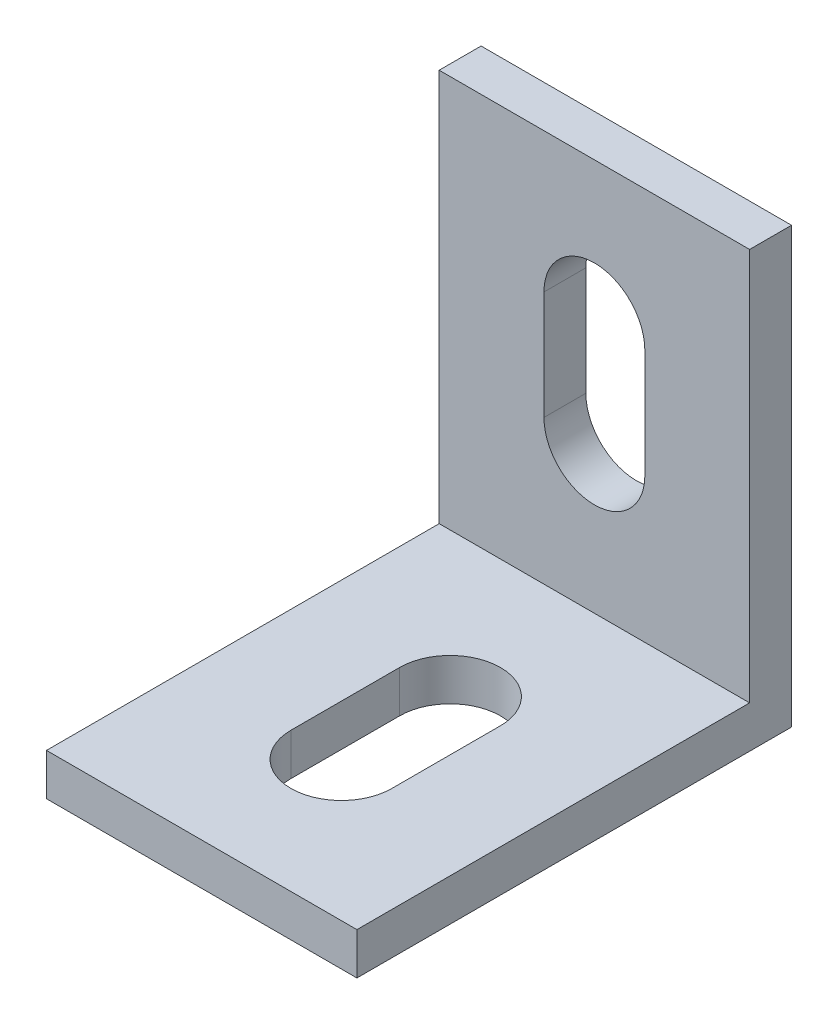
ISO-10303-21;
HEADER;
FILE_DESCRIPTION(('STEP AP214'),'2;1');
FILE_NAME('part.step','',(''),(''),'','','');
FILE_SCHEMA(('AUTOMOTIVE_DESIGN { 1 0 10303 214 1 1 1 1 }'));
ENDSEC;
DATA;
#1=APPLICATION_CONTEXT('core data for automotive mechanical design processes');
#2=APPLICATION_PROTOCOL_DEFINITION('international standard','automotive_design',2000,#1);
#3=PRODUCT_CONTEXT('',#1,'mechanical');
#4=PRODUCT('Part','Part','',(#3));
#5=PRODUCT_RELATED_PRODUCT_CATEGORY('part','',(#4));
#6=PRODUCT_DEFINITION_FORMATION('','',#4);
#7=PRODUCT_DEFINITION_CONTEXT('part definition',#1,'design');
#8=PRODUCT_DEFINITION('design','',#6,#7);
#9=PRODUCT_DEFINITION_SHAPE('','',#8);
#10=(LENGTH_UNIT() NAMED_UNIT(*) SI_UNIT(.MILLI.,.METRE.));
#11=(NAMED_UNIT(*) PLANE_ANGLE_UNIT() SI_UNIT($,.RADIAN.));
#12=(NAMED_UNIT(*) SI_UNIT($,.STERADIAN.) SOLID_ANGLE_UNIT());
#13=UNCERTAINTY_MEASURE_WITH_UNIT(LENGTH_MEASURE(1.E-05),#10,'distance_accuracy_value','');
#14=(GEOMETRIC_REPRESENTATION_CONTEXT(3) GLOBAL_UNCERTAINTY_ASSIGNED_CONTEXT((#13)) GLOBAL_UNIT_ASSIGNED_CONTEXT((#10,
#11,#12)) REPRESENTATION_CONTEXT('',''));
#15=CARTESIAN_POINT('',(0.,0.,0.));
#16=DIRECTION('',(0.,0.,1.));
#17=DIRECTION('',(1.,0.,0.));
#18=AXIS2_PLACEMENT_3D('',#15,#16,#17);
#19=CARTESIAN_POINT('',(0.,2.7,0.));
#20=DIRECTION('',(0.,1.,0.));
#21=DIRECTION('',(0.,0.,1.));
#22=AXIS2_PLACEMENT_3D('',#19,#20,#21);
#23=PLANE('',#22);
#24=DIRECTION('',(1.,0.,0.));
#25=VECTOR('',#24,1.);
#26=CARTESIAN_POINT('',(0.,2.7,-11.3));
#27=LINE('',#26,#25);
#28=CARTESIAN_POINT('',(-10.,2.7,-11.3));
#29=VERTEX_POINT('',#28);
#30=CARTESIAN_POINT('',(10.,2.7,-11.3));
#31=VERTEX_POINT('',#30);
#32=EDGE_CURVE('E59',#29,#31,#27,.T.);
#33=ORIENTED_EDGE('',*,*,#32,.F.);
#34=DIRECTION('',(0.,0.,1.));
#35=VECTOR('',#34,1.);
#36=CARTESIAN_POINT('',(-10.,2.7,-14.));
#37=LINE('',#36,#35);
#38=CARTESIAN_POINT('',(-10.,2.7,14.));
#39=VERTEX_POINT('',#38);
#40=EDGE_CURVE('E265',#29,#39,#37,.T.);
#41=ORIENTED_EDGE('',*,*,#40,.T.);
#42=DIRECTION('',(1.,0.,0.));
#43=VECTOR('',#42,1.);
#44=CARTESIAN_POINT('',(-10.,2.7,14.));
#45=LINE('',#44,#43);
#46=CARTESIAN_POINT('',(10.,2.7,14.));
#47=VERTEX_POINT('',#46);
#48=EDGE_CURVE('E269',#39,#47,#45,.T.);
#49=ORIENTED_EDGE('',*,*,#48,.T.);
#50=DIRECTION('',(0.,0.,-1.));
#51=VECTOR('',#50,1.);
#52=CARTESIAN_POINT('',(10.,2.7,-14.));
#53=LINE('',#52,#51);
#54=EDGE_CURVE('E55',#47,#31,#53,.T.);
#55=ORIENTED_EDGE('',*,*,#54,.T.);
#56=EDGE_LOOP('',(#33,#41,#49,#55));
#57=FACE_BOUND('',#56,.T.);
#58=DIRECTION('',(0.,0.,1.));
#59=VECTOR('',#58,1.);
#60=CARTESIAN_POINT('',(-3.25,2.7,-2.));
#61=LINE('',#60,#59);
#62=CARTESIAN_POINT('',(-3.25,2.7,-2.));
#63=VERTEX_POINT('',#62);
#64=CARTESIAN_POINT('',(-3.25,2.7,5.));
#65=VERTEX_POINT('',#64);
#66=EDGE_CURVE('E223',#63,#65,#61,.T.);
#67=ORIENTED_EDGE('',*,*,#66,.F.);
#68=CARTESIAN_POINT('',(0.,2.7,-2.));
#69=DIRECTION('',(0.,1.,0.));
#70=DIRECTION('',(0.,0.,1.));
#71=AXIS2_PLACEMENT_3D('',#68,#69,#70);
#72=CIRCLE('',#71,3.25);
#73=CARTESIAN_POINT('',(3.25,2.7,-2.));
#74=VERTEX_POINT('',#73);
#75=EDGE_CURVE('E220',#74,#63,#72,.T.);
#76=ORIENTED_EDGE('',*,*,#75,.F.);
#77=DIRECTION('',(0.,0.,-1.));
#78=VECTOR('',#77,1.);
#79=CARTESIAN_POINT('',(3.25,2.7,-2.));
#80=LINE('',#79,#78);
#81=CARTESIAN_POINT('',(3.25,2.7,5.));
#82=VERTEX_POINT('',#81);
#83=EDGE_CURVE('E231',#82,#74,#80,.T.);
#84=ORIENTED_EDGE('',*,*,#83,.F.);
#85=CARTESIAN_POINT('',(0.,2.7,5.));
#86=DIRECTION('',(0.,1.,0.));
#87=DIRECTION('',(0.,0.,1.));
#88=AXIS2_PLACEMENT_3D('',#85,#86,#87);
#89=CIRCLE('',#88,3.25);
#90=EDGE_CURVE('E227',#65,#82,#89,.T.);
#91=ORIENTED_EDGE('',*,*,#90,.F.);
#92=EDGE_LOOP('',(#67,#76,#84,#91));
#93=FACE_BOUND('',#92,.T.);
#94=ADVANCED_FACE('F39',(#57,#93),#23,.T.);
#95=CARTESIAN_POINT('',(0.,0.,0.));
#96=DIRECTION('',(0.,1.,0.));
#97=DIRECTION('',(0.,0.,1.));
#98=AXIS2_PLACEMENT_3D('',#95,#96,#97);
#99=PLANE('',#98);
#100=DIRECTION('',(1.,0.,0.));
#101=VECTOR('',#100,1.);
#102=CARTESIAN_POINT('',(-10.,0.,14.));
#103=LINE('',#102,#101);
#104=CARTESIAN_POINT('',(-10.,0.,14.));
#105=VERTEX_POINT('',#104);
#106=CARTESIAN_POINT('',(10.,0.,14.));
#107=VERTEX_POINT('',#106);
#108=EDGE_CURVE('E266',#105,#107,#103,.T.);
#109=ORIENTED_EDGE('',*,*,#108,.F.);
#110=DIRECTION('',(0.,0.,1.));
#111=VECTOR('',#110,1.);
#112=CARTESIAN_POINT('',(-10.,0.,-14.));
#113=LINE('',#112,#111);
#114=CARTESIAN_POINT('',(-10.,0.,-14.));
#115=VERTEX_POINT('',#114);
#116=EDGE_CURVE('E278',#115,#105,#113,.T.);
#117=ORIENTED_EDGE('',*,*,#116,.F.);
#118=DIRECTION('',(-1.,0.,0.));
#119=VECTOR('',#118,1.);
#120=CARTESIAN_POINT('',(-10.,0.,-14.));
#121=LINE('',#120,#119);
#122=CARTESIAN_POINT('',(10.,0.,-14.));
#123=VERTEX_POINT('',#122);
#124=EDGE_CURVE('E275',#123,#115,#121,.T.);
#125=ORIENTED_EDGE('',*,*,#124,.F.);
#126=DIRECTION('',(0.,0.,-1.));
#127=VECTOR('',#126,1.);
#128=CARTESIAN_POINT('',(10.,0.,-14.));
#129=LINE('',#128,#127);
#130=EDGE_CURVE('E262',#107,#123,#129,.T.);
#131=ORIENTED_EDGE('',*,*,#130,.F.);
#132=EDGE_LOOP('',(#109,#117,#125,#131));
#133=FACE_BOUND('',#132,.T.);
#134=CARTESIAN_POINT('',(0.,0.,-2.));
#135=DIRECTION('',(0.,1.,0.));
#136=DIRECTION('',(0.,0.,1.));
#137=AXIS2_PLACEMENT_3D('',#134,#135,#136);
#138=CIRCLE('',#137,3.25);
#139=CARTESIAN_POINT('',(3.25,0.,-2.));
#140=VERTEX_POINT('',#139);
#141=CARTESIAN_POINT('',(-3.25,0.,-2.));
#142=VERTEX_POINT('',#141);
#143=EDGE_CURVE('E219',#140,#142,#138,.T.);
#144=ORIENTED_EDGE('',*,*,#143,.T.);
#145=DIRECTION('',(0.,0.,1.));
#146=VECTOR('',#145,1.);
#147=CARTESIAN_POINT('',(-3.25,0.,-2.));
#148=LINE('',#147,#146);
#149=CARTESIAN_POINT('',(-3.25,0.,5.));
#150=VERTEX_POINT('',#149);
#151=EDGE_CURVE('E238',#142,#150,#148,.T.);
#152=ORIENTED_EDGE('',*,*,#151,.T.);
#153=CARTESIAN_POINT('',(0.,0.,5.));
#154=DIRECTION('',(0.,1.,0.));
#155=DIRECTION('',(0.,0.,1.));
#156=AXIS2_PLACEMENT_3D('',#153,#154,#155);
#157=CIRCLE('',#156,3.25);
#158=CARTESIAN_POINT('',(3.25,0.,5.));
#159=VERTEX_POINT('',#158);
#160=EDGE_CURVE('E242',#150,#159,#157,.T.);
#161=ORIENTED_EDGE('',*,*,#160,.T.);
#162=DIRECTION('',(0.,0.,-1.));
#163=VECTOR('',#162,1.);
#164=CARTESIAN_POINT('',(3.25,0.,-2.));
#165=LINE('',#164,#163);
#166=EDGE_CURVE('E224',#159,#140,#165,.T.);
#167=ORIENTED_EDGE('',*,*,#166,.T.);
#168=EDGE_LOOP('',(#144,#152,#161,#167));
#169=FACE_BOUND('',#168,.T.);
#170=ADVANCED_FACE('F301',(#133,#169),#99,.F.);
#171=CARTESIAN_POINT('',(10.,2.7,-14.));
#172=DIRECTION('',(-1.,0.,0.));
#173=DIRECTION('',(0.,0.,1.));
#174=AXIS2_PLACEMENT_3D('',#171,#172,#173);
#175=PLANE('',#174);
#176=ORIENTED_EDGE('',*,*,#130,.T.);
#177=DIRECTION('',(0.,-1.,0.));
#178=VECTOR('',#177,1.);
#179=CARTESIAN_POINT('',(10.,2.7,-14.));
#180=LINE('',#179,#178);
#181=CARTESIAN_POINT('',(10.,28.,-14.));
#182=VERTEX_POINT('',#181);
#183=EDGE_CURVE('E11',#182,#123,#180,.T.);
#184=ORIENTED_EDGE('',*,*,#183,.F.);
#185=DIRECTION('',(0.,0.,-1.));
#186=VECTOR('',#185,1.);
#187=CARTESIAN_POINT('',(10.,28.,-11.3));
#188=LINE('',#187,#186);
#189=CARTESIAN_POINT('',(10.,28.,-11.3));
#190=VERTEX_POINT('',#189);
#191=EDGE_CURVE('E210',#190,#182,#188,.T.);
#192=ORIENTED_EDGE('',*,*,#191,.F.);
#193=DIRECTION('',(0.,-1.,0.));
#194=VECTOR('',#193,1.);
#195=CARTESIAN_POINT('',(10.,0.,-11.3));
#196=LINE('',#195,#194);
#197=EDGE_CURVE('E195',#190,#31,#196,.T.);
#198=ORIENTED_EDGE('',*,*,#197,.T.);
#199=ORIENTED_EDGE('',*,*,#54,.F.);
#200=DIRECTION('',(0.,-1.,0.));
#201=VECTOR('',#200,1.);
#202=CARTESIAN_POINT('',(10.,2.7,14.));
#203=LINE('',#202,#201);
#204=EDGE_CURVE('E272',#47,#107,#203,.T.);
#205=ORIENTED_EDGE('',*,*,#204,.T.);
#206=EDGE_LOOP('',(#176,#184,#192,#198,#199,#205));
#207=FACE_BOUND('',#206,.T.);
#208=ADVANCED_FACE('F41',(#207),#175,.F.);
#209=CARTESIAN_POINT('',(-10.,2.7,-14.));
#210=DIRECTION('',(0.,0.,1.));
#211=DIRECTION('',(1.,0.,0.));
#212=AXIS2_PLACEMENT_3D('',#209,#210,#211);
#213=PLANE('',#212);
#214=ORIENTED_EDGE('',*,*,#124,.T.);
#215=DIRECTION('',(0.,-1.,0.));
#216=VECTOR('',#215,1.);
#217=CARTESIAN_POINT('',(-10.,2.7,-14.));
#218=LINE('',#217,#216);
#219=CARTESIAN_POINT('',(-10.,28.,-14.));
#220=VERTEX_POINT('',#219);
#221=EDGE_CURVE('E48',#220,#115,#218,.T.);
#222=ORIENTED_EDGE('',*,*,#221,.F.);
#223=DIRECTION('',(1.,0.,0.));
#224=VECTOR('',#223,1.);
#225=CARTESIAN_POINT('',(10.,28.,-14.));
#226=LINE('',#225,#224);
#227=EDGE_CURVE('E189',#220,#182,#226,.T.);
#228=ORIENTED_EDGE('',*,*,#227,.T.);
#229=ORIENTED_EDGE('',*,*,#183,.T.);
#230=EDGE_LOOP('',(#214,#222,#228,#229));
#231=FACE_BOUND('',#230,.T.);
#232=DIRECTION('',(0.,1.,0.));
#233=VECTOR('',#232,1.);
#234=CARTESIAN_POINT('',(-3.25,12.,-14.));
#235=LINE('',#234,#233);
#236=CARTESIAN_POINT('',(-3.25,12.,-14.));
#237=VERTEX_POINT('',#236);
#238=CARTESIAN_POINT('',(-3.25,19.,-14.));
#239=VERTEX_POINT('',#238);
#240=EDGE_CURVE('E180',#237,#239,#235,.T.);
#241=ORIENTED_EDGE('',*,*,#240,.F.);
#242=CARTESIAN_POINT('',(0.,12.,-14.));
#243=DIRECTION('',(0.,0.,-1.));
#244=DIRECTION('',(-1.,0.,0.));
#245=AXIS2_PLACEMENT_3D('',#242,#243,#244);
#246=CIRCLE('',#245,3.25);
#247=CARTESIAN_POINT('',(3.25,12.,-14.));
#248=VERTEX_POINT('',#247);
#249=EDGE_CURVE('E146',#248,#237,#246,.T.);
#250=ORIENTED_EDGE('',*,*,#249,.F.);
#251=DIRECTION('',(0.,-1.,0.));
#252=VECTOR('',#251,1.);
#253=CARTESIAN_POINT('',(3.25,12.,-14.));
#254=LINE('',#253,#252);
#255=CARTESIAN_POINT('',(3.25,19.,-14.));
#256=VERTEX_POINT('',#255);
#257=EDGE_CURVE('E167',#256,#248,#254,.T.);
#258=ORIENTED_EDGE('',*,*,#257,.F.);
#259=CARTESIAN_POINT('',(0.,19.,-14.));
#260=DIRECTION('',(0.,0.,-1.));
#261=DIRECTION('',(-1.,0.,0.));
#262=AXIS2_PLACEMENT_3D('',#259,#260,#261);
#263=CIRCLE('',#262,3.25);
#264=EDGE_CURVE('E171',#239,#256,#263,.T.);
#265=ORIENTED_EDGE('',*,*,#264,.F.);
#266=EDGE_LOOP('',(#241,#250,#258,#265));
#267=FACE_BOUND('',#266,.T.);
#268=ADVANCED_FACE('F314',(#231,#267),#213,.F.);
#269=CARTESIAN_POINT('',(-10.,2.7,-14.));
#270=DIRECTION('',(1.,0.,0.));
#271=DIRECTION('',(0.,0.,-1.));
#272=AXIS2_PLACEMENT_3D('',#269,#270,#271);
#273=PLANE('',#272);
#274=ORIENTED_EDGE('',*,*,#40,.F.);
#275=DIRECTION('',(0.,1.,0.));
#276=VECTOR('',#275,1.);
#277=CARTESIAN_POINT('',(-10.,0.,-11.3));
#278=LINE('',#277,#276);
#279=CARTESIAN_POINT('',(-10.,28.,-11.3));
#280=VERTEX_POINT('',#279);
#281=EDGE_CURVE('E199',#29,#280,#278,.T.);
#282=ORIENTED_EDGE('',*,*,#281,.T.);
#283=DIRECTION('',(0.,0.,-1.));
#284=VECTOR('',#283,1.);
#285=CARTESIAN_POINT('',(-10.,28.,-11.3));
#286=LINE('',#285,#284);
#287=EDGE_CURVE('E206',#280,#220,#286,.T.);
#288=ORIENTED_EDGE('',*,*,#287,.T.);
#289=ORIENTED_EDGE('',*,*,#221,.T.);
#290=ORIENTED_EDGE('',*,*,#116,.T.);
#291=DIRECTION('',(0.,-1.,0.));
#292=VECTOR('',#291,1.);
#293=CARTESIAN_POINT('',(-10.,2.7,14.));
#294=LINE('',#293,#292);
#295=EDGE_CURVE('E286',#39,#105,#294,.T.);
#296=ORIENTED_EDGE('',*,*,#295,.F.);
#297=EDGE_LOOP('',(#274,#282,#288,#289,#290,#296));
#298=FACE_BOUND('',#297,.T.);
#299=ADVANCED_FACE('F293',(#298),#273,.F.);
#300=CARTESIAN_POINT('',(-10.,2.7,14.));
#301=DIRECTION('',(0.,0.,-1.));
#302=DIRECTION('',(-1.,0.,0.));
#303=AXIS2_PLACEMENT_3D('',#300,#301,#302);
#304=PLANE('',#303);
#305=ORIENTED_EDGE('',*,*,#108,.T.);
#306=ORIENTED_EDGE('',*,*,#204,.F.);
#307=ORIENTED_EDGE('',*,*,#48,.F.);
#308=ORIENTED_EDGE('',*,*,#295,.T.);
#309=EDGE_LOOP('',(#305,#306,#307,#308));
#310=FACE_BOUND('',#309,.T.);
#311=ADVANCED_FACE('F306',(#310),#304,.F.);
#312=CARTESIAN_POINT('',(0.,2.7,-2.));
#313=DIRECTION('',(0.,-1.,0.));
#314=DIRECTION('',(0.,0.,-1.));
#315=AXIS2_PLACEMENT_3D('',#312,#313,#314);
#316=CYLINDRICAL_SURFACE('',#315,3.25);
#317=ORIENTED_EDGE('',*,*,#143,.F.);
#318=DIRECTION('',(0.,-1.,0.));
#319=VECTOR('',#318,1.);
#320=CARTESIAN_POINT('',(3.25,2.7,-2.));
#321=LINE('',#320,#319);
#322=EDGE_CURVE('E234',#74,#140,#321,.T.);
#323=ORIENTED_EDGE('',*,*,#322,.F.);
#324=ORIENTED_EDGE('',*,*,#75,.T.);
#325=DIRECTION('',(0.,-1.,0.));
#326=VECTOR('',#325,1.);
#327=CARTESIAN_POINT('',(-3.25,2.7,-2.));
#328=LINE('',#327,#326);
#329=EDGE_CURVE('E258',#63,#142,#328,.T.);
#330=ORIENTED_EDGE('',*,*,#329,.T.);
#331=EDGE_LOOP('',(#317,#323,#324,#330));
#332=FACE_BOUND('',#331,.T.);
#333=ADVANCED_FACE('F339',(#332),#316,.F.);
#334=CARTESIAN_POINT('',(-3.25,2.7,-2.));
#335=DIRECTION('',(1.,0.,0.));
#336=DIRECTION('',(0.,0.,-1.));
#337=AXIS2_PLACEMENT_3D('',#334,#335,#336);
#338=PLANE('',#337);
#339=ORIENTED_EDGE('',*,*,#151,.F.);
#340=ORIENTED_EDGE('',*,*,#329,.F.);
#341=ORIENTED_EDGE('',*,*,#66,.T.);
#342=DIRECTION('',(0.,-1.,0.));
#343=VECTOR('',#342,1.);
#344=CARTESIAN_POINT('',(-3.25,2.7,5.));
#345=LINE('',#344,#343);
#346=EDGE_CURVE('E255',#65,#150,#345,.T.);
#347=ORIENTED_EDGE('',*,*,#346,.T.);
#348=EDGE_LOOP('',(#339,#340,#341,#347));
#349=FACE_BOUND('',#348,.T.);
#350=ADVANCED_FACE('F361',(#349),#338,.T.);
#351=CARTESIAN_POINT('',(0.,2.7,5.));
#352=DIRECTION('',(0.,-1.,0.));
#353=DIRECTION('',(0.,0.,-1.));
#354=AXIS2_PLACEMENT_3D('',#351,#352,#353);
#355=CYLINDRICAL_SURFACE('',#354,3.25);
#356=ORIENTED_EDGE('',*,*,#160,.F.);
#357=ORIENTED_EDGE('',*,*,#346,.F.);
#358=ORIENTED_EDGE('',*,*,#90,.T.);
#359=DIRECTION('',(0.,-1.,0.));
#360=VECTOR('',#359,1.);
#361=CARTESIAN_POINT('',(3.25,2.7,5.));
#362=LINE('',#361,#360);
#363=EDGE_CURVE('E252',#82,#159,#362,.T.);
#364=ORIENTED_EDGE('',*,*,#363,.T.);
#365=EDGE_LOOP('',(#356,#357,#358,#364));
#366=FACE_BOUND('',#365,.T.);
#367=ADVANCED_FACE('F368',(#366),#355,.F.);
#368=CARTESIAN_POINT('',(3.25,2.7,-2.));
#369=DIRECTION('',(-1.,0.,0.));
#370=DIRECTION('',(0.,0.,1.));
#371=AXIS2_PLACEMENT_3D('',#368,#369,#370);
#372=PLANE('',#371);
#373=ORIENTED_EDGE('',*,*,#166,.F.);
#374=ORIENTED_EDGE('',*,*,#363,.F.);
#375=ORIENTED_EDGE('',*,*,#83,.T.);
#376=ORIENTED_EDGE('',*,*,#322,.T.);
#377=EDGE_LOOP('',(#373,#374,#375,#376));
#378=FACE_BOUND('',#377,.T.);
#379=ADVANCED_FACE('F375',(#378),#372,.T.);
#380=CARTESIAN_POINT('',(10.,28.,-11.3));
#381=DIRECTION('',(0.,1.,0.));
#382=DIRECTION('',(0.,0.,1.));
#383=AXIS2_PLACEMENT_3D('',#380,#381,#382);
#384=PLANE('',#383);
#385=ORIENTED_EDGE('',*,*,#227,.F.);
#386=ORIENTED_EDGE('',*,*,#287,.F.);
#387=DIRECTION('',(1.,0.,0.));
#388=VECTOR('',#387,1.);
#389=CARTESIAN_POINT('',(10.,28.,-11.3));
#390=LINE('',#389,#388);
#391=EDGE_CURVE('E202',#280,#190,#390,.T.);
#392=ORIENTED_EDGE('',*,*,#391,.T.);
#393=ORIENTED_EDGE('',*,*,#191,.T.);
#394=EDGE_LOOP('',(#385,#386,#392,#393));
#395=FACE_BOUND('',#394,.T.);
#396=ADVANCED_FACE('F313',(#395),#384,.T.);
#397=CARTESIAN_POINT('',(0.,0.,-11.3));
#398=DIRECTION('',(0.,0.,1.));
#399=DIRECTION('',(1.,0.,0.));
#400=AXIS2_PLACEMENT_3D('',#397,#398,#399);
#401=PLANE('',#400);
#402=CARTESIAN_POINT('',(0.,12.,-11.3));
#403=DIRECTION('',(0.,0.,-1.));
#404=DIRECTION('',(-1.,0.,0.));
#405=AXIS2_PLACEMENT_3D('',#402,#403,#404);
#406=CIRCLE('',#405,3.25);
#407=CARTESIAN_POINT('',(3.25,12.,-11.3));
#408=VERTEX_POINT('',#407);
#409=CARTESIAN_POINT('',(-3.25,12.,-11.3));
#410=VERTEX_POINT('',#409);
#411=EDGE_CURVE('E143',#408,#410,#406,.T.);
#412=ORIENTED_EDGE('',*,*,#411,.T.);
#413=DIRECTION('',(0.,1.,0.));
#414=VECTOR('',#413,1.);
#415=CARTESIAN_POINT('',(-3.25,12.,-11.3));
#416=LINE('',#415,#414);
#417=CARTESIAN_POINT('',(-3.25,19.,-11.3));
#418=VERTEX_POINT('',#417);
#419=EDGE_CURVE('E156',#410,#418,#416,.T.);
#420=ORIENTED_EDGE('',*,*,#419,.T.);
#421=CARTESIAN_POINT('',(0.,19.,-11.3));
#422=DIRECTION('',(0.,0.,-1.));
#423=DIRECTION('',(-1.,0.,0.));
#424=AXIS2_PLACEMENT_3D('',#421,#422,#423);
#425=CIRCLE('',#424,3.25);
#426=CARTESIAN_POINT('',(3.25,19.,-11.3));
#427=VERTEX_POINT('',#426);
#428=EDGE_CURVE('E161',#418,#427,#425,.T.);
#429=ORIENTED_EDGE('',*,*,#428,.T.);
#430=DIRECTION('',(0.,-1.,0.));
#431=VECTOR('',#430,1.);
#432=CARTESIAN_POINT('',(3.25,12.,-11.3));
#433=LINE('',#432,#431);
#434=EDGE_CURVE('E152',#427,#408,#433,.T.);
#435=ORIENTED_EDGE('',*,*,#434,.T.);
#436=EDGE_LOOP('',(#412,#420,#429,#435));
#437=FACE_BOUND('',#436,.T.);
#438=ORIENTED_EDGE('',*,*,#281,.F.);
#439=ORIENTED_EDGE('',*,*,#32,.T.);
#440=ORIENTED_EDGE('',*,*,#197,.F.);
#441=ORIENTED_EDGE('',*,*,#391,.F.);
#442=EDGE_LOOP('',(#438,#439,#440,#441));
#443=FACE_BOUND('',#442,.T.);
#444=ADVANCED_FACE('F163',(#437,#443),#401,.T.);
#445=CARTESIAN_POINT('',(0.,12.,-11.3));
#446=DIRECTION('',(0.,0.,-1.));
#447=DIRECTION('',(-1.,0.,0.));
#448=AXIS2_PLACEMENT_3D('',#445,#446,#447);
#449=CYLINDRICAL_SURFACE('',#448,3.25);
#450=ORIENTED_EDGE('',*,*,#249,.T.);
#451=DIRECTION('',(0.,0.,-1.));
#452=VECTOR('',#451,1.);
#453=CARTESIAN_POINT('',(-3.25,12.,-11.3));
#454=LINE('',#453,#452);
#455=EDGE_CURVE('E139',#410,#237,#454,.T.);
#456=ORIENTED_EDGE('',*,*,#455,.F.);
#457=ORIENTED_EDGE('',*,*,#411,.F.);
#458=DIRECTION('',(0.,0.,-1.));
#459=VECTOR('',#458,1.);
#460=CARTESIAN_POINT('',(3.25,12.,-11.3));
#461=LINE('',#460,#459);
#462=EDGE_CURVE('E186',#408,#248,#461,.T.);
#463=ORIENTED_EDGE('',*,*,#462,.T.);
#464=EDGE_LOOP('',(#450,#456,#457,#463));
#465=FACE_BOUND('',#464,.T.);
#466=ADVANCED_FACE('F141',(#465),#449,.F.);
#467=CARTESIAN_POINT('',(3.25,12.,-11.3));
#468=DIRECTION('',(1.,0.,0.));
#469=DIRECTION('',(0.,0.,-1.));
#470=AXIS2_PLACEMENT_3D('',#467,#468,#469);
#471=PLANE('',#470);
#472=ORIENTED_EDGE('',*,*,#257,.T.);
#473=ORIENTED_EDGE('',*,*,#462,.F.);
#474=ORIENTED_EDGE('',*,*,#434,.F.);
#475=DIRECTION('',(0.,0.,-1.));
#476=VECTOR('',#475,1.);
#477=CARTESIAN_POINT('',(3.25,19.,-11.3));
#478=LINE('',#477,#476);
#479=EDGE_CURVE('E190',#427,#256,#478,.T.);
#480=ORIENTED_EDGE('',*,*,#479,.T.);
#481=EDGE_LOOP('',(#472,#473,#474,#480));
#482=FACE_BOUND('',#481,.T.);
#483=ADVANCED_FACE('F322',(#482),#471,.F.);
#484=CARTESIAN_POINT('',(0.,19.,-11.3));
#485=DIRECTION('',(0.,0.,-1.));
#486=DIRECTION('',(-1.,0.,0.));
#487=AXIS2_PLACEMENT_3D('',#484,#485,#486);
#488=CYLINDRICAL_SURFACE('',#487,3.25);
#489=ORIENTED_EDGE('',*,*,#264,.T.);
#490=ORIENTED_EDGE('',*,*,#479,.F.);
#491=ORIENTED_EDGE('',*,*,#428,.F.);
#492=DIRECTION('',(0.,0.,-1.));
#493=VECTOR('',#492,1.);
#494=CARTESIAN_POINT('',(-3.25,19.,-11.3));
#495=LINE('',#494,#493);
#496=EDGE_CURVE('E151',#418,#239,#495,.T.);
#497=ORIENTED_EDGE('',*,*,#496,.T.);
#498=EDGE_LOOP('',(#489,#490,#491,#497));
#499=FACE_BOUND('',#498,.T.);
#500=ADVANCED_FACE('F320',(#499),#488,.F.);
#501=CARTESIAN_POINT('',(-3.25,12.,-11.3));
#502=DIRECTION('',(-1.,0.,0.));
#503=DIRECTION('',(0.,0.,1.));
#504=AXIS2_PLACEMENT_3D('',#501,#502,#503);
#505=PLANE('',#504);
#506=ORIENTED_EDGE('',*,*,#240,.T.);
#507=ORIENTED_EDGE('',*,*,#496,.F.);
#508=ORIENTED_EDGE('',*,*,#419,.F.);
#509=ORIENTED_EDGE('',*,*,#455,.T.);
#510=EDGE_LOOP('',(#506,#507,#508,#509));
#511=FACE_BOUND('',#510,.T.);
#512=ADVANCED_FACE('F157',(#511),#505,.F.);
#513=CLOSED_SHELL('',(#94,#170,#208,#268,#299,#311,#333,#350,#367,#379,#396,#444,#466,#483,#500,#512));
#514=MANIFOLD_SOLID_BREP('B2',#513);
#515=ADVANCED_BREP_SHAPE_REPRESENTATION('',(#18,#514),#14);
#516=SHAPE_DEFINITION_REPRESENTATION(#9,#515);
ENDSEC;
END-ISO-10303-21;
